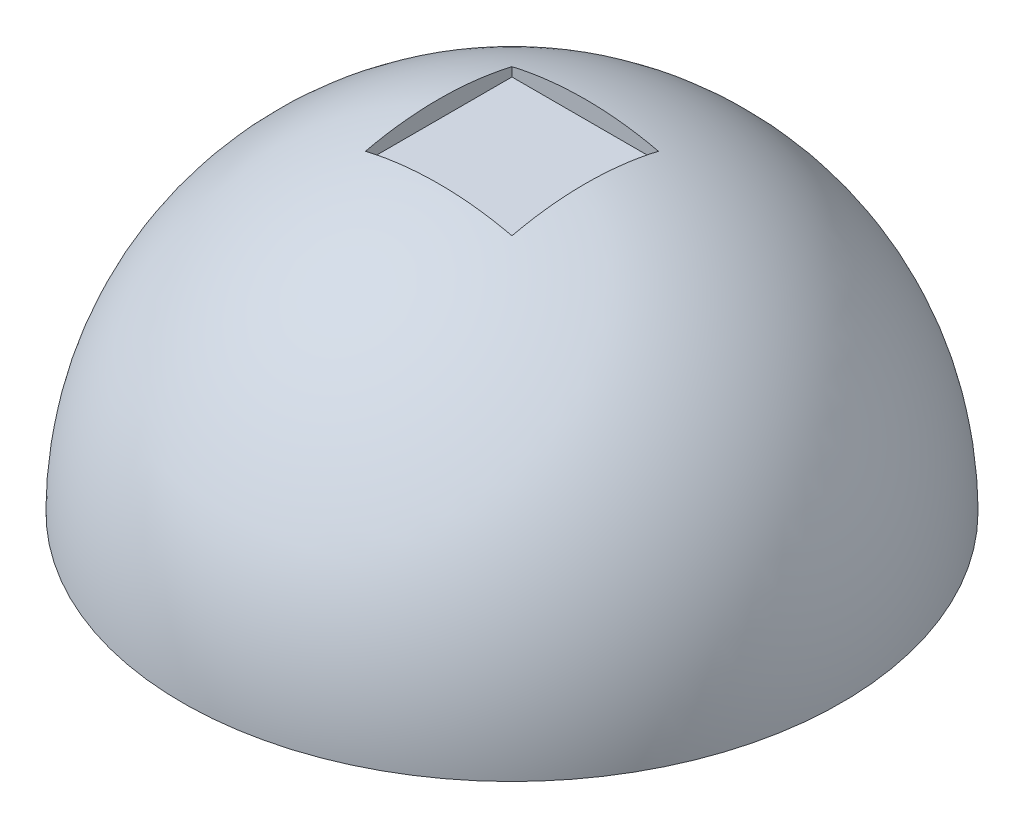
ISO-10303-21;
HEADER;
FILE_DESCRIPTION(('STEP AP214'),'2;1');
FILE_NAME('part.step','',(''),(''),'','','');
FILE_SCHEMA(('AUTOMOTIVE_DESIGN { 1 0 10303 214 1 1 1 1 }'));
ENDSEC;
DATA;
#1=APPLICATION_CONTEXT('core data for automotive mechanical design processes');
#2=APPLICATION_PROTOCOL_DEFINITION('international standard','automotive_design',2000,#1);
#3=PRODUCT_CONTEXT('',#1,'mechanical');
#4=PRODUCT('Part','Part','',(#3));
#5=PRODUCT_RELATED_PRODUCT_CATEGORY('part','',(#4));
#6=PRODUCT_DEFINITION_FORMATION('','',#4);
#7=PRODUCT_DEFINITION_CONTEXT('part definition',#1,'design');
#8=PRODUCT_DEFINITION('design','',#6,#7);
#9=PRODUCT_DEFINITION_SHAPE('','',#8);
#10=(LENGTH_UNIT() NAMED_UNIT(*) SI_UNIT(.MILLI.,.METRE.));
#11=(NAMED_UNIT(*) PLANE_ANGLE_UNIT() SI_UNIT($,.RADIAN.));
#12=(NAMED_UNIT(*) SI_UNIT($,.STERADIAN.) SOLID_ANGLE_UNIT());
#13=UNCERTAINTY_MEASURE_WITH_UNIT(LENGTH_MEASURE(1.E-05),#10,'distance_accuracy_value','');
#14=(GEOMETRIC_REPRESENTATION_CONTEXT(3) GLOBAL_UNCERTAINTY_ASSIGNED_CONTEXT((#13)) GLOBAL_UNIT_ASSIGNED_CONTEXT((#10,
#11,#12)) REPRESENTATION_CONTEXT('',''));
#15=CARTESIAN_POINT('',(0.,0.,0.));
#16=DIRECTION('',(0.,0.,1.));
#17=DIRECTION('',(1.,0.,0.));
#18=AXIS2_PLACEMENT_3D('',#15,#16,#17);
#19=CARTESIAN_POINT('',(0.,0.,0.));
#20=DIRECTION('',(0.,-1.,0.));
#21=DIRECTION('',(1.,0.,0.));
#22=AXIS2_PLACEMENT_3D('',#19,#20,#21);
#23=SPHERICAL_SURFACE('',#22,228.6);
#24=CARTESIAN_POINT('',(0.,0.,0.));
#25=DIRECTION('',(0.,-1.,0.));
#26=DIRECTION('',(0.,0.,-1.));
#27=AXIS2_PLACEMENT_3D('',#24,#25,#26);
#28=CIRCLE('',#27,228.6);
#29=CARTESIAN_POINT('',(0.,0.,-228.6));
#30=VERTEX_POINT('',#29);
#31=EDGE_CURVE('E97',#30,#30,#28,.T.);
#32=ORIENTED_EDGE('',*,*,#31,.F.);
#33=EDGE_LOOP('',(#32));
#34=FACE_BOUND('',#33,.T.);
#35=CARTESIAN_POINT('',(0.,0.,50.8));
#36=DIRECTION('',(0.,0.,1.));
#37=DIRECTION('',(1.,0.,0.));
#38=AXIS2_PLACEMENT_3D('',#35,#36,#37);
#39=CIRCLE('',#38,222.88409543976);
#40=CARTESIAN_POINT('',(-50.8,217.017695131065,50.8));
#41=VERTEX_POINT('',#40);
#42=CARTESIAN_POINT('',(50.8,217.017695131065,50.8));
#43=VERTEX_POINT('',#42);
#44=EDGE_CURVE('E101',#41,#43,#39,.F.);
#45=ORIENTED_EDGE('',*,*,#44,.F.);
#46=CARTESIAN_POINT('',(-50.8,0.,0.));
#47=DIRECTION('',(1.,0.,0.));
#48=DIRECTION('',(0.,0.,-1.));
#49=AXIS2_PLACEMENT_3D('',#46,#47,#48);
#50=CIRCLE('',#49,222.88409543976);
#51=CARTESIAN_POINT('',(-50.8,217.017695131065,-50.8));
#52=VERTEX_POINT('',#51);
#53=EDGE_CURVE('E11',#41,#52,#50,.F.);
#54=ORIENTED_EDGE('',*,*,#53,.T.);
#55=CARTESIAN_POINT('',(0.,0.,-50.8));
#56=DIRECTION('',(0.,0.,1.));
#57=DIRECTION('',(1.,0.,0.));
#58=AXIS2_PLACEMENT_3D('',#55,#56,#57);
#59=CIRCLE('',#58,222.88409543976);
#60=CARTESIAN_POINT('',(50.8,217.017695131065,-50.8));
#61=VERTEX_POINT('',#60);
#62=EDGE_CURVE('E49',#52,#61,#59,.F.);
#63=ORIENTED_EDGE('',*,*,#62,.T.);
#64=CARTESIAN_POINT('',(50.8,0.,0.));
#65=DIRECTION('',(1.,0.,0.));
#66=DIRECTION('',(0.,0.,-1.));
#67=AXIS2_PLACEMENT_3D('',#64,#65,#66);
#68=CIRCLE('',#67,222.88409543976);
#69=EDGE_CURVE('E108',#43,#61,#68,.F.);
#70=ORIENTED_EDGE('',*,*,#69,.F.);
#71=EDGE_LOOP('',(#45,#54,#63,#70));
#72=FACE_BOUND('',#71,.T.);
#73=ADVANCED_FACE('F41',(#34,#72),#23,.T.);
#74=CARTESIAN_POINT('',(0.,0.,0.));
#75=DIRECTION('',(0.,-1.,0.));
#76=DIRECTION('',(0.,0.,-1.));
#77=AXIS2_PLACEMENT_3D('',#74,#75,#76);
#78=PLANE('',#77);
#79=ORIENTED_EDGE('',*,*,#31,.T.);
#80=EDGE_LOOP('',(#79));
#81=FACE_BOUND('',#80,.T.);
#82=ADVANCED_FACE('F43',(#81),#78,.T.);
#83=CARTESIAN_POINT('',(-50.8,210.82,50.8));
#84=DIRECTION('',(1.,0.,0.));
#85=DIRECTION('',(0.,0.,-1.));
#86=AXIS2_PLACEMENT_3D('',#83,#84,#85);
#87=PLANE('',#86);
#88=DIRECTION('',(0.,1.,0.));
#89=VECTOR('',#88,1.);
#90=CARTESIAN_POINT('',(-50.8,210.82,50.8));
#91=LINE('',#90,#89);
#92=CARTESIAN_POINT('',(-50.8,210.82,50.8));
#93=VERTEX_POINT('',#92);
#94=EDGE_CURVE('E56',#93,#41,#91,.T.);
#95=ORIENTED_EDGE('',*,*,#94,.F.);
#96=DIRECTION('',(0.,0.,-1.));
#97=VECTOR('',#96,1.);
#98=CARTESIAN_POINT('',(-50.8,210.82,50.8));
#99=LINE('',#98,#97);
#100=CARTESIAN_POINT('',(-50.8,210.82,-50.8));
#101=VERTEX_POINT('',#100);
#102=EDGE_CURVE('E87',#93,#101,#99,.T.);
#103=ORIENTED_EDGE('',*,*,#102,.T.);
#104=DIRECTION('',(0.,1.,0.));
#105=VECTOR('',#104,1.);
#106=CARTESIAN_POINT('',(-50.8,210.82,-50.8));
#107=LINE('',#106,#105);
#108=EDGE_CURVE('E94',#101,#52,#107,.T.);
#109=ORIENTED_EDGE('',*,*,#108,.T.);
#110=ORIENTED_EDGE('',*,*,#53,.F.);
#111=EDGE_LOOP('',(#95,#103,#109,#110));
#112=FACE_BOUND('',#111,.T.);
#113=ADVANCED_FACE('F93',(#112),#87,.T.);
#114=CARTESIAN_POINT('',(-50.8,210.82,-50.8));
#115=DIRECTION('',(0.,0.,1.));
#116=DIRECTION('',(1.,0.,0.));
#117=AXIS2_PLACEMENT_3D('',#114,#115,#116);
#118=PLANE('',#117);
#119=ORIENTED_EDGE('',*,*,#108,.F.);
#120=DIRECTION('',(1.,0.,0.));
#121=VECTOR('',#120,1.);
#122=CARTESIAN_POINT('',(-50.8,210.82,-50.8));
#123=LINE('',#122,#121);
#124=CARTESIAN_POINT('',(50.8,210.82,-50.8));
#125=VERTEX_POINT('',#124);
#126=EDGE_CURVE('E83',#101,#125,#123,.T.);
#127=ORIENTED_EDGE('',*,*,#126,.T.);
#128=DIRECTION('',(0.,1.,0.));
#129=VECTOR('',#128,1.);
#130=CARTESIAN_POINT('',(50.8,210.82,-50.8));
#131=LINE('',#130,#129);
#132=EDGE_CURVE('E98',#125,#61,#131,.T.);
#133=ORIENTED_EDGE('',*,*,#132,.T.);
#134=ORIENTED_EDGE('',*,*,#62,.F.);
#135=EDGE_LOOP('',(#119,#127,#133,#134));
#136=FACE_BOUND('',#135,.T.);
#137=ADVANCED_FACE('F96',(#136),#118,.T.);
#138=CARTESIAN_POINT('',(50.8,210.82,50.8));
#139=DIRECTION('',(1.,0.,0.));
#140=DIRECTION('',(0.,0.,-1.));
#141=AXIS2_PLACEMENT_3D('',#138,#139,#140);
#142=PLANE('',#141);
#143=ORIENTED_EDGE('',*,*,#69,.T.);
#144=ORIENTED_EDGE('',*,*,#132,.F.);
#145=DIRECTION('',(0.,0.,-1.));
#146=VECTOR('',#145,1.);
#147=CARTESIAN_POINT('',(50.8,210.82,50.8));
#148=LINE('',#147,#146);
#149=CARTESIAN_POINT('',(50.8,210.82,50.8));
#150=VERTEX_POINT('',#149);
#151=EDGE_CURVE('E89',#150,#125,#148,.T.);
#152=ORIENTED_EDGE('',*,*,#151,.F.);
#153=DIRECTION('',(0.,1.,0.));
#154=VECTOR('',#153,1.);
#155=CARTESIAN_POINT('',(50.8,210.82,50.8));
#156=LINE('',#155,#154);
#157=EDGE_CURVE('E103',#150,#43,#156,.T.);
#158=ORIENTED_EDGE('',*,*,#157,.T.);
#159=EDGE_LOOP('',(#143,#144,#152,#158));
#160=FACE_BOUND('',#159,.T.);
#161=ADVANCED_FACE('F115',(#160),#142,.F.);
#162=CARTESIAN_POINT('',(-50.8,210.82,50.8));
#163=DIRECTION('',(0.,0.,1.));
#164=DIRECTION('',(1.,0.,0.));
#165=AXIS2_PLACEMENT_3D('',#162,#163,#164);
#166=PLANE('',#165);
#167=ORIENTED_EDGE('',*,*,#44,.T.);
#168=ORIENTED_EDGE('',*,*,#157,.F.);
#169=DIRECTION('',(1.,0.,0.));
#170=VECTOR('',#169,1.);
#171=CARTESIAN_POINT('',(-50.8,210.82,50.8));
#172=LINE('',#171,#170);
#173=EDGE_CURVE('E116',#93,#150,#172,.T.);
#174=ORIENTED_EDGE('',*,*,#173,.F.);
#175=ORIENTED_EDGE('',*,*,#94,.T.);
#176=EDGE_LOOP('',(#167,#168,#174,#175));
#177=FACE_BOUND('',#176,.T.);
#178=ADVANCED_FACE('F113',(#177),#166,.F.);
#179=CARTESIAN_POINT('',(0.,210.82,0.));
#180=DIRECTION('',(0.,-1.,0.));
#181=DIRECTION('',(0.,0.,-1.));
#182=AXIS2_PLACEMENT_3D('',#179,#180,#181);
#183=PLANE('',#182);
#184=ORIENTED_EDGE('',*,*,#102,.F.);
#185=ORIENTED_EDGE('',*,*,#173,.T.);
#186=ORIENTED_EDGE('',*,*,#151,.T.);
#187=ORIENTED_EDGE('',*,*,#126,.F.);
#188=EDGE_LOOP('',(#184,#185,#186,#187));
#189=FACE_BOUND('',#188,.T.);
#190=ADVANCED_FACE('F85',(#189),#183,.F.);
#191=CLOSED_SHELL('',(#73,#82,#113,#137,#161,#178,#190));
#192=MANIFOLD_SOLID_BREP('B2',#191);
#193=ADVANCED_BREP_SHAPE_REPRESENTATION('',(#18,#192),#14);
#194=SHAPE_DEFINITION_REPRESENTATION(#9,#193);
ENDSEC;
END-ISO-10303-21;
